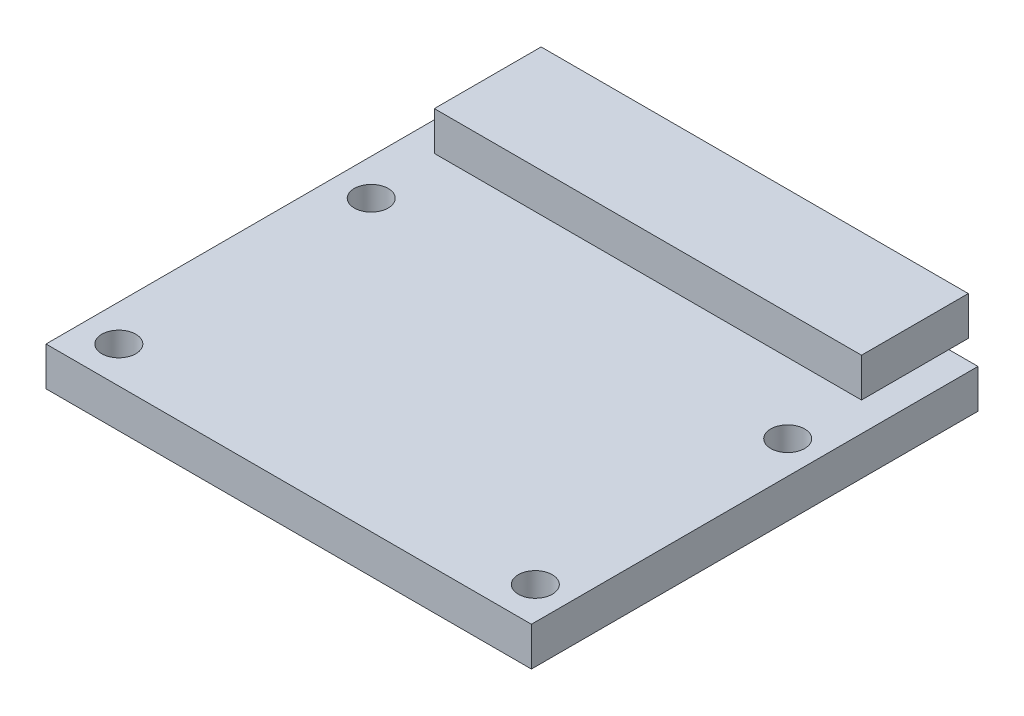
ISO-10303-21;
HEADER;
FILE_DESCRIPTION(('STEP AP214'),'2;1');
FILE_NAME('part.step','',(''),(''),'','','');
FILE_SCHEMA(('AUTOMOTIVE_DESIGN { 1 0 10303 214 1 1 1 1 }'));
ENDSEC;
DATA;
#1=APPLICATION_CONTEXT('core data for automotive mechanical design processes');
#2=APPLICATION_PROTOCOL_DEFINITION('international standard','automotive_design',2000,#1);
#3=PRODUCT_CONTEXT('',#1,'mechanical');
#4=PRODUCT('Part','Part','',(#3));
#5=PRODUCT_RELATED_PRODUCT_CATEGORY('part','',(#4));
#6=PRODUCT_DEFINITION_FORMATION('','',#4);
#7=PRODUCT_DEFINITION_CONTEXT('part definition',#1,'design');
#8=PRODUCT_DEFINITION('design','',#6,#7);
#9=PRODUCT_DEFINITION_SHAPE('','',#8);
#10=(LENGTH_UNIT() NAMED_UNIT(*) SI_UNIT(.MILLI.,.METRE.));
#11=(NAMED_UNIT(*) PLANE_ANGLE_UNIT() SI_UNIT($,.RADIAN.));
#12=(NAMED_UNIT(*) SI_UNIT($,.STERADIAN.) SOLID_ANGLE_UNIT());
#13=UNCERTAINTY_MEASURE_WITH_UNIT(LENGTH_MEASURE(1.E-05),#10,'distance_accuracy_value','');
#14=(GEOMETRIC_REPRESENTATION_CONTEXT(3) GLOBAL_UNCERTAINTY_ASSIGNED_CONTEXT((#13)) GLOBAL_UNIT_ASSIGNED_CONTEXT((#10,
#11,#12)) REPRESENTATION_CONTEXT('',''));
#15=CARTESIAN_POINT('',(0.,0.,0.));
#16=DIRECTION('',(0.,0.,1.));
#17=DIRECTION('',(1.,0.,0.));
#18=AXIS2_PLACEMENT_3D('',#15,#16,#17);
#19=CARTESIAN_POINT('',(0.,2.,0.));
#20=DIRECTION('',(0.,-1.,0.));
#21=DIRECTION('',(0.,0.,-1.));
#22=AXIS2_PLACEMENT_3D('',#19,#20,#21);
#23=PLANE('',#22);
#24=CARTESIAN_POINT('',(-10.625,2.,9.625));
#25=DIRECTION('',(0.,-1.,0.));
#26=DIRECTION('',(0.,0.,-1.));
#27=AXIS2_PLACEMENT_3D('',#24,#25,#26);
#28=CIRCLE('',#27,0.875);
#29=CARTESIAN_POINT('',(-10.625,2.,8.75));
#30=VERTEX_POINT('',#29);
#31=EDGE_CURVE('E186',#30,#30,#28,.T.);
#32=ORIENTED_EDGE('',*,*,#31,.T.);
#33=EDGE_LOOP('',(#32));
#34=FACE_BOUND('',#33,.T.);
#35=CARTESIAN_POINT('',(10.825,2.,9.625));
#36=DIRECTION('',(0.,-1.,0.));
#37=DIRECTION('',(0.,0.,-1.));
#38=AXIS2_PLACEMENT_3D('',#35,#36,#37);
#39=CIRCLE('',#38,0.875);
#40=CARTESIAN_POINT('',(10.825,2.,8.75));
#41=VERTEX_POINT('',#40);
#42=EDGE_CURVE('E190',#41,#41,#39,.T.);
#43=ORIENTED_EDGE('',*,*,#42,.T.);
#44=EDGE_LOOP('',(#43));
#45=FACE_BOUND('',#44,.T.);
#46=CARTESIAN_POINT('',(10.825,2.,-3.375));
#47=DIRECTION('',(0.,-1.,0.));
#48=DIRECTION('',(0.,0.,-1.));
#49=AXIS2_PLACEMENT_3D('',#46,#47,#48);
#50=CIRCLE('',#49,0.875);
#51=CARTESIAN_POINT('',(10.825,2.,-4.25));
#52=VERTEX_POINT('',#51);
#53=EDGE_CURVE('E194',#52,#52,#50,.T.);
#54=ORIENTED_EDGE('',*,*,#53,.T.);
#55=EDGE_LOOP('',(#54));
#56=FACE_BOUND('',#55,.T.);
#57=CARTESIAN_POINT('',(-10.625,2.,-3.375));
#58=DIRECTION('',(0.,-1.,0.));
#59=DIRECTION('',(0.,0.,-1.));
#60=AXIS2_PLACEMENT_3D('',#57,#58,#59);
#61=CIRCLE('',#60,0.875);
#62=CARTESIAN_POINT('',(-10.625,2.,-4.25));
#63=VERTEX_POINT('',#62);
#64=EDGE_CURVE('E198',#63,#63,#61,.T.);
#65=ORIENTED_EDGE('',*,*,#64,.T.);
#66=EDGE_LOOP('',(#65));
#67=FACE_BOUND('',#66,.T.);
#68=DIRECTION('',(0.,0.,-1.));
#69=VECTOR('',#68,1.);
#70=CARTESIAN_POINT('',(11.,2.,-7.));
#71=LINE('',#70,#69);
#72=CARTESIAN_POINT('',(11.,2.,-7.));
#73=VERTEX_POINT('',#72);
#74=CARTESIAN_POINT('',(11.,2.,-11.5));
#75=VERTEX_POINT('',#74);
#76=EDGE_CURVE('E58',#73,#75,#71,.T.);
#77=ORIENTED_EDGE('',*,*,#76,.F.);
#78=DIRECTION('',(1.,0.,0.));
#79=VECTOR('',#78,1.);
#80=CARTESIAN_POINT('',(-11.,2.,-7.));
#81=LINE('',#80,#79);
#82=CARTESIAN_POINT('',(-11.,2.,-7.));
#83=VERTEX_POINT('',#82);
#84=EDGE_CURVE('E157',#83,#73,#81,.T.);
#85=ORIENTED_EDGE('',*,*,#84,.F.);
#86=DIRECTION('',(0.,0.,1.));
#87=VECTOR('',#86,1.);
#88=CARTESIAN_POINT('',(-11.,2.,-7.));
#89=LINE('',#88,#87);
#90=CARTESIAN_POINT('',(-11.,2.,-11.5));
#91=VERTEX_POINT('',#90);
#92=EDGE_CURVE('E11',#91,#83,#89,.T.);
#93=ORIENTED_EDGE('',*,*,#92,.F.);
#94=DIRECTION('',(-1.,0.,0.));
#95=VECTOR('',#94,1.);
#96=CARTESIAN_POINT('',(-12.5,2.,-11.5));
#97=LINE('',#96,#95);
#98=CARTESIAN_POINT('',(-12.5,2.,-11.5));
#99=VERTEX_POINT('',#98);
#100=EDGE_CURVE('E259',#91,#99,#97,.T.);
#101=ORIENTED_EDGE('',*,*,#100,.T.);
#102=DIRECTION('',(0.,0.,1.));
#103=VECTOR('',#102,1.);
#104=CARTESIAN_POINT('',(-12.5,2.,11.5));
#105=LINE('',#104,#103);
#106=CARTESIAN_POINT('',(-12.5,2.,11.5));
#107=VERTEX_POINT('',#106);
#108=EDGE_CURVE('E264',#99,#107,#105,.T.);
#109=ORIENTED_EDGE('',*,*,#108,.T.);
#110=DIRECTION('',(1.,0.,0.));
#111=VECTOR('',#110,1.);
#112=CARTESIAN_POINT('',(-12.5,2.,11.5));
#113=LINE('',#112,#111);
#114=CARTESIAN_POINT('',(12.5,2.,11.5));
#115=VERTEX_POINT('',#114);
#116=EDGE_CURVE('E268',#107,#115,#113,.T.);
#117=ORIENTED_EDGE('',*,*,#116,.T.);
#118=DIRECTION('',(0.,0.,-1.));
#119=VECTOR('',#118,1.);
#120=CARTESIAN_POINT('',(12.5,2.,11.5));
#121=LINE('',#120,#119);
#122=CARTESIAN_POINT('',(12.5,2.,-11.5));
#123=VERTEX_POINT('',#122);
#124=EDGE_CURVE('E255',#115,#123,#121,.T.);
#125=ORIENTED_EDGE('',*,*,#124,.T.);
#126=EDGE_CURVE('E261',#123,#75,#97,.T.);
#127=ORIENTED_EDGE('',*,*,#126,.T.);
#128=EDGE_LOOP('',(#77,#85,#93,#101,#109,#117,#125,#127));
#129=FACE_BOUND('',#128,.T.);
#130=ADVANCED_FACE('F39',(#34,#45,#56,#67,#129),#23,.F.);
#131=CARTESIAN_POINT('',(12.5,2.,11.5));
#132=DIRECTION('',(-1.,0.,0.));
#133=DIRECTION('',(0.,0.,1.));
#134=AXIS2_PLACEMENT_3D('',#131,#132,#133);
#135=PLANE('',#134);
#136=DIRECTION('',(0.,0.,-1.));
#137=VECTOR('',#136,1.);
#138=CARTESIAN_POINT('',(12.5,0.,11.5));
#139=LINE('',#138,#137);
#140=CARTESIAN_POINT('',(12.5,0.,11.5));
#141=VERTEX_POINT('',#140);
#142=CARTESIAN_POINT('',(12.5,0.,-11.5));
#143=VERTEX_POINT('',#142);
#144=EDGE_CURVE('E254',#141,#143,#139,.T.);
#145=ORIENTED_EDGE('',*,*,#144,.T.);
#146=DIRECTION('',(0.,-1.,0.));
#147=VECTOR('',#146,1.);
#148=CARTESIAN_POINT('',(12.5,2.,-11.5));
#149=LINE('',#148,#147);
#150=EDGE_CURVE('E43',#123,#143,#149,.T.);
#151=ORIENTED_EDGE('',*,*,#150,.F.);
#152=ORIENTED_EDGE('',*,*,#124,.F.);
#153=DIRECTION('',(0.,-1.,0.));
#154=VECTOR('',#153,1.);
#155=CARTESIAN_POINT('',(12.5,2.,11.5));
#156=LINE('',#155,#154);
#157=EDGE_CURVE('E271',#115,#141,#156,.T.);
#158=ORIENTED_EDGE('',*,*,#157,.T.);
#159=EDGE_LOOP('',(#145,#151,#152,#158));
#160=FACE_BOUND('',#159,.T.);
#161=ADVANCED_FACE('F41',(#160),#135,.F.);
#162=CARTESIAN_POINT('',(-12.5,2.,-11.5));
#163=DIRECTION('',(0.,0.,1.));
#164=DIRECTION('',(1.,0.,0.));
#165=AXIS2_PLACEMENT_3D('',#162,#163,#164);
#166=PLANE('',#165);
#167=DIRECTION('',(-1.,0.,0.));
#168=VECTOR('',#167,1.);
#169=CARTESIAN_POINT('',(-12.5,0.,-11.5));
#170=LINE('',#169,#168);
#171=CARTESIAN_POINT('',(-12.5,0.,-11.5));
#172=VERTEX_POINT('',#171);
#173=EDGE_CURVE('E275',#143,#172,#170,.T.);
#174=ORIENTED_EDGE('',*,*,#173,.T.);
#175=DIRECTION('',(0.,-1.,0.));
#176=VECTOR('',#175,1.);
#177=CARTESIAN_POINT('',(-12.5,2.,-11.5));
#178=LINE('',#177,#176);
#179=EDGE_CURVE('E289',#99,#172,#178,.T.);
#180=ORIENTED_EDGE('',*,*,#179,.F.);
#181=ORIENTED_EDGE('',*,*,#100,.F.);
#182=EDGE_CURVE('E265',#75,#91,#97,.T.);
#183=ORIENTED_EDGE('',*,*,#182,.F.);
#184=ORIENTED_EDGE('',*,*,#126,.F.);
#185=ORIENTED_EDGE('',*,*,#150,.T.);
#186=EDGE_LOOP('',(#174,#180,#181,#183,#184,#185));
#187=FACE_BOUND('',#186,.T.);
#188=ADVANCED_FACE('F300',(#187),#166,.F.);
#189=CARTESIAN_POINT('',(-12.5,2.,11.5));
#190=DIRECTION('',(1.,0.,0.));
#191=DIRECTION('',(0.,0.,-1.));
#192=AXIS2_PLACEMENT_3D('',#189,#190,#191);
#193=PLANE('',#192);
#194=DIRECTION('',(0.,0.,1.));
#195=VECTOR('',#194,1.);
#196=CARTESIAN_POINT('',(-12.5,0.,11.5));
#197=LINE('',#196,#195);
#198=CARTESIAN_POINT('',(-12.5,0.,11.5));
#199=VERTEX_POINT('',#198);
#200=EDGE_CURVE('E278',#172,#199,#197,.T.);
#201=ORIENTED_EDGE('',*,*,#200,.T.);
#202=DIRECTION('',(0.,-1.,0.));
#203=VECTOR('',#202,1.);
#204=CARTESIAN_POINT('',(-12.5,2.,11.5));
#205=LINE('',#204,#203);
#206=EDGE_CURVE('E286',#107,#199,#205,.T.);
#207=ORIENTED_EDGE('',*,*,#206,.F.);
#208=ORIENTED_EDGE('',*,*,#108,.F.);
#209=ORIENTED_EDGE('',*,*,#179,.T.);
#210=EDGE_LOOP('',(#201,#207,#208,#209));
#211=FACE_BOUND('',#210,.T.);
#212=ADVANCED_FACE('F309',(#211),#193,.F.);
#213=CARTESIAN_POINT('',(-12.5,2.,11.5));
#214=DIRECTION('',(0.,0.,-1.));
#215=DIRECTION('',(-1.,0.,0.));
#216=AXIS2_PLACEMENT_3D('',#213,#214,#215);
#217=PLANE('',#216);
#218=DIRECTION('',(1.,0.,0.));
#219=VECTOR('',#218,1.);
#220=CARTESIAN_POINT('',(-12.5,0.,11.5));
#221=LINE('',#220,#219);
#222=EDGE_CURVE('E260',#199,#141,#221,.T.);
#223=ORIENTED_EDGE('',*,*,#222,.T.);
#224=ORIENTED_EDGE('',*,*,#157,.F.);
#225=ORIENTED_EDGE('',*,*,#116,.F.);
#226=ORIENTED_EDGE('',*,*,#206,.T.);
#227=EDGE_LOOP('',(#223,#224,#225,#226));
#228=FACE_BOUND('',#227,.T.);
#229=ADVANCED_FACE('F312',(#228),#217,.F.);
#230=CARTESIAN_POINT('',(0.,0.,0.));
#231=DIRECTION('',(0.,-1.,0.));
#232=DIRECTION('',(0.,0.,-1.));
#233=AXIS2_PLACEMENT_3D('',#230,#231,#232);
#234=PLANE('',#233);
#235=CARTESIAN_POINT('',(-10.625,0.,-3.375));
#236=DIRECTION('',(0.,-1.,0.));
#237=DIRECTION('',(0.,0.,-1.));
#238=AXIS2_PLACEMENT_3D('',#235,#236,#237);
#239=CIRCLE('',#238,0.875);
#240=CARTESIAN_POINT('',(-10.625,0.,-4.25));
#241=VERTEX_POINT('',#240);
#242=EDGE_CURVE('E164',#241,#241,#239,.T.);
#243=ORIENTED_EDGE('',*,*,#242,.F.);
#244=EDGE_LOOP('',(#243));
#245=FACE_BOUND('',#244,.T.);
#246=CARTESIAN_POINT('',(10.825,0.,-3.375));
#247=DIRECTION('',(0.,-1.,0.));
#248=DIRECTION('',(0.,0.,-1.));
#249=AXIS2_PLACEMENT_3D('',#246,#247,#248);
#250=CIRCLE('',#249,0.875);
#251=CARTESIAN_POINT('',(10.825,0.,-4.25));
#252=VERTEX_POINT('',#251);
#253=EDGE_CURVE('E169',#252,#252,#250,.T.);
#254=ORIENTED_EDGE('',*,*,#253,.F.);
#255=EDGE_LOOP('',(#254));
#256=FACE_BOUND('',#255,.T.);
#257=CARTESIAN_POINT('',(10.825,0.,9.625));
#258=DIRECTION('',(0.,-1.,0.));
#259=DIRECTION('',(0.,0.,-1.));
#260=AXIS2_PLACEMENT_3D('',#257,#258,#259);
#261=CIRCLE('',#260,0.875);
#262=CARTESIAN_POINT('',(10.825,0.,8.75));
#263=VERTEX_POINT('',#262);
#264=EDGE_CURVE('E175',#263,#263,#261,.T.);
#265=ORIENTED_EDGE('',*,*,#264,.F.);
#266=EDGE_LOOP('',(#265));
#267=FACE_BOUND('',#266,.T.);
#268=CARTESIAN_POINT('',(-10.625,0.,9.625));
#269=DIRECTION('',(0.,-1.,0.));
#270=DIRECTION('',(0.,0.,-1.));
#271=AXIS2_PLACEMENT_3D('',#268,#269,#270);
#272=CIRCLE('',#271,0.875);
#273=CARTESIAN_POINT('',(-10.625,0.,8.75));
#274=VERTEX_POINT('',#273);
#275=EDGE_CURVE('E179',#274,#274,#272,.T.);
#276=ORIENTED_EDGE('',*,*,#275,.F.);
#277=EDGE_LOOP('',(#276));
#278=FACE_BOUND('',#277,.T.);
#279=DIRECTION('',(0.,0.,1.));
#280=VECTOR('',#279,1.);
#281=CARTESIAN_POINT('',(4.25,0.,-6.));
#282=LINE('',#281,#280);
#283=CARTESIAN_POINT('',(4.25,0.,-6.));
#284=VERTEX_POINT('',#283);
#285=CARTESIAN_POINT('',(4.25,0.,2.5));
#286=VERTEX_POINT('',#285);
#287=EDGE_CURVE('E206',#284,#286,#282,.T.);
#288=ORIENTED_EDGE('',*,*,#287,.F.);
#289=DIRECTION('',(1.,0.,0.));
#290=VECTOR('',#289,1.);
#291=CARTESIAN_POINT('',(-4.25,0.,-6.));
#292=LINE('',#291,#290);
#293=CARTESIAN_POINT('',(-4.25,0.,-6.));
#294=VERTEX_POINT('',#293);
#295=EDGE_CURVE('E215',#294,#284,#292,.T.);
#296=ORIENTED_EDGE('',*,*,#295,.F.);
#297=DIRECTION('',(0.,0.,-1.));
#298=VECTOR('',#297,1.);
#299=CARTESIAN_POINT('',(-4.25,0.,-6.));
#300=LINE('',#299,#298);
#301=CARTESIAN_POINT('',(-4.25,0.,2.5));
#302=VERTEX_POINT('',#301);
#303=EDGE_CURVE('E232',#302,#294,#300,.T.);
#304=ORIENTED_EDGE('',*,*,#303,.F.);
#305=DIRECTION('',(-1.,0.,0.));
#306=VECTOR('',#305,1.);
#307=CARTESIAN_POINT('',(-4.25,0.,2.5));
#308=LINE('',#307,#306);
#309=EDGE_CURVE('E228',#286,#302,#308,.T.);
#310=ORIENTED_EDGE('',*,*,#309,.F.);
#311=EDGE_LOOP('',(#288,#296,#304,#310));
#312=FACE_BOUND('',#311,.T.);
#313=ORIENTED_EDGE('',*,*,#144,.F.);
#314=ORIENTED_EDGE('',*,*,#222,.F.);
#315=ORIENTED_EDGE('',*,*,#200,.F.);
#316=ORIENTED_EDGE('',*,*,#173,.F.);
#317=EDGE_LOOP('',(#313,#314,#315,#316));
#318=FACE_BOUND('',#317,.T.);
#319=ADVANCED_FACE('F307',(#245,#256,#267,#278,#312,#318),#234,.T.);
#320=CARTESIAN_POINT('',(4.25,-3.,-6.));
#321=DIRECTION('',(-1.,0.,0.));
#322=DIRECTION('',(0.,0.,1.));
#323=AXIS2_PLACEMENT_3D('',#320,#321,#322);
#324=PLANE('',#323);
#325=ORIENTED_EDGE('',*,*,#287,.T.);
#326=DIRECTION('',(0.,1.,0.));
#327=VECTOR('',#326,1.);
#328=CARTESIAN_POINT('',(4.25,-3.,2.5));
#329=LINE('',#328,#327);
#330=CARTESIAN_POINT('',(4.25,-3.,2.5));
#331=VERTEX_POINT('',#330);
#332=EDGE_CURVE('E250',#331,#286,#329,.T.);
#333=ORIENTED_EDGE('',*,*,#332,.F.);
#334=DIRECTION('',(0.,0.,1.));
#335=VECTOR('',#334,1.);
#336=CARTESIAN_POINT('',(4.25,-3.,-6.));
#337=LINE('',#336,#335);
#338=CARTESIAN_POINT('',(4.25,-3.,-6.));
#339=VERTEX_POINT('',#338);
#340=EDGE_CURVE('E210',#339,#331,#337,.T.);
#341=ORIENTED_EDGE('',*,*,#340,.F.);
#342=DIRECTION('',(0.,1.,0.));
#343=VECTOR('',#342,1.);
#344=CARTESIAN_POINT('',(4.25,-3.,-6.));
#345=LINE('',#344,#343);
#346=EDGE_CURVE('E224',#339,#284,#345,.T.);
#347=ORIENTED_EDGE('',*,*,#346,.T.);
#348=EDGE_LOOP('',(#325,#333,#341,#347));
#349=FACE_BOUND('',#348,.T.);
#350=ADVANCED_FACE('F361',(#349),#324,.F.);
#351=CARTESIAN_POINT('',(-4.25,-3.,2.5));
#352=DIRECTION('',(0.,0.,-1.));
#353=DIRECTION('',(-1.,0.,0.));
#354=AXIS2_PLACEMENT_3D('',#351,#352,#353);
#355=PLANE('',#354);
#356=ORIENTED_EDGE('',*,*,#309,.T.);
#357=DIRECTION('',(0.,1.,0.));
#358=VECTOR('',#357,1.);
#359=CARTESIAN_POINT('',(-4.25,-3.,2.5));
#360=LINE('',#359,#358);
#361=CARTESIAN_POINT('',(-4.25,-3.,2.5));
#362=VERTEX_POINT('',#361);
#363=EDGE_CURVE('E246',#362,#302,#360,.T.);
#364=ORIENTED_EDGE('',*,*,#363,.F.);
#365=DIRECTION('',(-1.,0.,0.));
#366=VECTOR('',#365,1.);
#367=CARTESIAN_POINT('',(-4.25,-3.,2.5));
#368=LINE('',#367,#366);
#369=EDGE_CURVE('E214',#331,#362,#368,.T.);
#370=ORIENTED_EDGE('',*,*,#369,.F.);
#371=ORIENTED_EDGE('',*,*,#332,.T.);
#372=EDGE_LOOP('',(#356,#364,#370,#371));
#373=FACE_BOUND('',#372,.T.);
#374=ADVANCED_FACE('F395',(#373),#355,.F.);
#375=CARTESIAN_POINT('',(-4.25,-3.,-6.));
#376=DIRECTION('',(1.,0.,0.));
#377=DIRECTION('',(0.,0.,-1.));
#378=AXIS2_PLACEMENT_3D('',#375,#376,#377);
#379=PLANE('',#378);
#380=ORIENTED_EDGE('',*,*,#303,.T.);
#381=DIRECTION('',(0.,1.,0.));
#382=VECTOR('',#381,1.);
#383=CARTESIAN_POINT('',(-4.25,-3.,-6.));
#384=LINE('',#383,#382);
#385=CARTESIAN_POINT('',(-4.25,-3.,-6.));
#386=VERTEX_POINT('',#385);
#387=EDGE_CURVE('E242',#386,#294,#384,.T.);
#388=ORIENTED_EDGE('',*,*,#387,.F.);
#389=DIRECTION('',(0.,0.,-1.));
#390=VECTOR('',#389,1.);
#391=CARTESIAN_POINT('',(-4.25,-3.,-6.));
#392=LINE('',#391,#390);
#393=EDGE_CURVE('E218',#362,#386,#392,.T.);
#394=ORIENTED_EDGE('',*,*,#393,.F.);
#395=ORIENTED_EDGE('',*,*,#363,.T.);
#396=EDGE_LOOP('',(#380,#388,#394,#395));
#397=FACE_BOUND('',#396,.T.);
#398=ADVANCED_FACE('F402',(#397),#379,.F.);
#399=CARTESIAN_POINT('',(-4.25,-3.,-6.));
#400=DIRECTION('',(0.,0.,1.));
#401=DIRECTION('',(1.,0.,0.));
#402=AXIS2_PLACEMENT_3D('',#399,#400,#401);
#403=PLANE('',#402);
#404=ORIENTED_EDGE('',*,*,#295,.T.);
#405=ORIENTED_EDGE('',*,*,#346,.F.);
#406=DIRECTION('',(1.,0.,0.));
#407=VECTOR('',#406,1.);
#408=CARTESIAN_POINT('',(-4.25,-3.,-6.));
#409=LINE('',#408,#407);
#410=EDGE_CURVE('E221',#386,#339,#409,.T.);
#411=ORIENTED_EDGE('',*,*,#410,.F.);
#412=ORIENTED_EDGE('',*,*,#387,.T.);
#413=EDGE_LOOP('',(#404,#405,#411,#412));
#414=FACE_BOUND('',#413,.T.);
#415=ADVANCED_FACE('F409',(#414),#403,.F.);
#416=CARTESIAN_POINT('',(0.,-3.,0.));
#417=DIRECTION('',(0.,1.,0.));
#418=DIRECTION('',(0.,0.,1.));
#419=AXIS2_PLACEMENT_3D('',#416,#417,#418);
#420=PLANE('',#419);
#421=CARTESIAN_POINT('',(0.,-3.,-1.75));
#422=DIRECTION('',(0.,-1.,0.));
#423=DIRECTION('',(0.,0.,-1.));
#424=AXIS2_PLACEMENT_3D('',#421,#422,#423);
#425=CIRCLE('',#424,3.75);
#426=CARTESIAN_POINT('',(0.,-3.,-5.5));
#427=VERTEX_POINT('',#426);
#428=EDGE_CURVE('E49',#427,#427,#425,.T.);
#429=ORIENTED_EDGE('',*,*,#428,.F.);
#430=EDGE_LOOP('',(#429));
#431=FACE_BOUND('',#430,.T.);
#432=ORIENTED_EDGE('',*,*,#340,.T.);
#433=ORIENTED_EDGE('',*,*,#369,.T.);
#434=ORIENTED_EDGE('',*,*,#393,.T.);
#435=ORIENTED_EDGE('',*,*,#410,.T.);
#436=EDGE_LOOP('',(#432,#433,#434,#435));
#437=FACE_BOUND('',#436,.T.);
#438=ADVANCED_FACE('F417',(#431,#437),#420,.F.);
#439=CARTESIAN_POINT('',(0.,-6.,-1.75));
#440=DIRECTION('',(0.,1.,0.));
#441=DIRECTION('',(0.,0.,1.));
#442=AXIS2_PLACEMENT_3D('',#439,#440,#441);
#443=CYLINDRICAL_SURFACE('',#442,3.75);
#444=CARTESIAN_POINT('',(0.,-6.,-1.75));
#445=DIRECTION('',(0.,-1.,0.));
#446=DIRECTION('',(0.,0.,-1.));
#447=AXIS2_PLACEMENT_3D('',#444,#445,#446);
#448=CIRCLE('',#447,3.75);
#449=CARTESIAN_POINT('',(0.,-6.,-5.5));
#450=VERTEX_POINT('',#449);
#451=EDGE_CURVE('E202',#450,#450,#448,.T.);
#452=ORIENTED_EDGE('',*,*,#451,.F.);
#453=EDGE_LOOP('',(#452));
#454=FACE_BOUND('',#453,.T.);
#455=ORIENTED_EDGE('',*,*,#428,.T.);
#456=EDGE_LOOP('',(#455));
#457=FACE_BOUND('',#456,.T.);
#458=ADVANCED_FACE('F425',(#454,#457),#443,.T.);
#459=CARTESIAN_POINT('',(0.,-6.,-1.75));
#460=DIRECTION('',(0.,-1.,0.));
#461=DIRECTION('',(0.,0.,-1.));
#462=AXIS2_PLACEMENT_3D('',#459,#460,#461);
#463=PLANE('',#462);
#464=ORIENTED_EDGE('',*,*,#451,.T.);
#465=EDGE_LOOP('',(#464));
#466=FACE_BOUND('',#465,.T.);
#467=ADVANCED_FACE('F433',(#466),#463,.T.);
#468=CARTESIAN_POINT('',(-10.625,3.,9.625));
#469=DIRECTION('',(0.,-1.,0.));
#470=DIRECTION('',(0.,0.,-1.));
#471=AXIS2_PLACEMENT_3D('',#468,#469,#470);
#472=CYLINDRICAL_SURFACE('',#471,0.875);
#473=ORIENTED_EDGE('',*,*,#275,.T.);
#474=EDGE_LOOP('',(#473));
#475=FACE_BOUND('',#474,.T.);
#476=ORIENTED_EDGE('',*,*,#31,.F.);
#477=EDGE_LOOP('',(#476));
#478=FACE_BOUND('',#477,.T.);
#479=ADVANCED_FACE('F440',(#475,#478),#472,.F.);
#480=CARTESIAN_POINT('',(10.825,3.,9.625));
#481=DIRECTION('',(0.,-1.,0.));
#482=DIRECTION('',(0.,0.,-1.));
#483=AXIS2_PLACEMENT_3D('',#480,#481,#482);
#484=CYLINDRICAL_SURFACE('',#483,0.875);
#485=ORIENTED_EDGE('',*,*,#264,.T.);
#486=EDGE_LOOP('',(#485));
#487=FACE_BOUND('',#486,.T.);
#488=ORIENTED_EDGE('',*,*,#42,.F.);
#489=EDGE_LOOP('',(#488));
#490=FACE_BOUND('',#489,.T.);
#491=ADVANCED_FACE('F447',(#487,#490),#484,.F.);
#492=CARTESIAN_POINT('',(10.825,3.,-3.375));
#493=DIRECTION('',(0.,-1.,0.));
#494=DIRECTION('',(0.,0.,-1.));
#495=AXIS2_PLACEMENT_3D('',#492,#493,#494);
#496=CYLINDRICAL_SURFACE('',#495,0.875);
#497=ORIENTED_EDGE('',*,*,#253,.T.);
#498=EDGE_LOOP('',(#497));
#499=FACE_BOUND('',#498,.T.);
#500=ORIENTED_EDGE('',*,*,#53,.F.);
#501=EDGE_LOOP('',(#500));
#502=FACE_BOUND('',#501,.T.);
#503=ADVANCED_FACE('F455',(#499,#502),#496,.F.);
#504=CARTESIAN_POINT('',(-10.625,3.,-3.375));
#505=DIRECTION('',(0.,-1.,0.));
#506=DIRECTION('',(0.,0.,-1.));
#507=AXIS2_PLACEMENT_3D('',#504,#505,#506);
#508=CYLINDRICAL_SURFACE('',#507,0.875);
#509=ORIENTED_EDGE('',*,*,#242,.T.);
#510=EDGE_LOOP('',(#509));
#511=FACE_BOUND('',#510,.T.);
#512=ORIENTED_EDGE('',*,*,#64,.F.);
#513=EDGE_LOOP('',(#512));
#514=FACE_BOUND('',#513,.T.);
#515=ADVANCED_FACE('F463',(#511,#514),#508,.F.);
#516=CARTESIAN_POINT('',(11.,4.,-7.));
#517=DIRECTION('',(-1.,0.,0.));
#518=DIRECTION('',(0.,0.,1.));
#519=AXIS2_PLACEMENT_3D('',#516,#517,#518);
#520=PLANE('',#519);
#521=ORIENTED_EDGE('',*,*,#76,.T.);
#522=CARTESIAN_POINT('',(11.,2.,-12.5));
#523=VERTEX_POINT('',#522);
#524=EDGE_CURVE('E161',#75,#523,#71,.T.);
#525=ORIENTED_EDGE('',*,*,#524,.T.);
#526=DIRECTION('',(0.,-1.,0.));
#527=VECTOR('',#526,1.);
#528=CARTESIAN_POINT('',(11.,4.,-12.5));
#529=LINE('',#528,#527);
#530=CARTESIAN_POINT('',(11.,4.,-12.5));
#531=VERTEX_POINT('',#530);
#532=EDGE_CURVE('E140',#531,#523,#529,.T.);
#533=ORIENTED_EDGE('',*,*,#532,.F.);
#534=DIRECTION('',(0.,0.,-1.));
#535=VECTOR('',#534,1.);
#536=CARTESIAN_POINT('',(11.,4.,-7.));
#537=LINE('',#536,#535);
#538=CARTESIAN_POINT('',(11.,4.,-7.));
#539=VERTEX_POINT('',#538);
#540=EDGE_CURVE('E147',#539,#531,#537,.T.);
#541=ORIENTED_EDGE('',*,*,#540,.F.);
#542=DIRECTION('',(0.,-1.,0.));
#543=VECTOR('',#542,1.);
#544=CARTESIAN_POINT('',(11.,4.,-7.));
#545=LINE('',#544,#543);
#546=EDGE_CURVE('E332',#539,#73,#545,.T.);
#547=ORIENTED_EDGE('',*,*,#546,.T.);
#548=EDGE_LOOP('',(#521,#525,#533,#541,#547));
#549=FACE_BOUND('',#548,.T.);
#550=ADVANCED_FACE('F159',(#549),#520,.F.);
#551=CARTESIAN_POINT('',(-11.,4.,-12.5));
#552=DIRECTION('',(0.,0.,1.));
#553=DIRECTION('',(1.,0.,0.));
#554=AXIS2_PLACEMENT_3D('',#551,#552,#553);
#555=PLANE('',#554);
#556=DIRECTION('',(-1.,0.,0.));
#557=VECTOR('',#556,1.);
#558=CARTESIAN_POINT('',(-11.,2.,-12.5));
#559=LINE('',#558,#557);
#560=CARTESIAN_POINT('',(-11.,2.,-12.5));
#561=VERTEX_POINT('',#560);
#562=EDGE_CURVE('E325',#523,#561,#559,.T.);
#563=ORIENTED_EDGE('',*,*,#562,.T.);
#564=DIRECTION('',(0.,-1.,0.));
#565=VECTOR('',#564,1.);
#566=CARTESIAN_POINT('',(-11.,4.,-12.5));
#567=LINE('',#566,#565);
#568=CARTESIAN_POINT('',(-11.,4.,-12.5));
#569=VERTEX_POINT('',#568);
#570=EDGE_CURVE('E142',#569,#561,#567,.T.);
#571=ORIENTED_EDGE('',*,*,#570,.F.);
#572=DIRECTION('',(-1.,0.,0.));
#573=VECTOR('',#572,1.);
#574=CARTESIAN_POINT('',(-11.,4.,-12.5));
#575=LINE('',#574,#573);
#576=EDGE_CURVE('E136',#531,#569,#575,.T.);
#577=ORIENTED_EDGE('',*,*,#576,.F.);
#578=ORIENTED_EDGE('',*,*,#532,.T.);
#579=EDGE_LOOP('',(#563,#571,#577,#578));
#580=FACE_BOUND('',#579,.T.);
#581=ADVANCED_FACE('F138',(#580),#555,.F.);
#582=CARTESIAN_POINT('',(-11.,4.,-7.));
#583=DIRECTION('',(1.,0.,0.));
#584=DIRECTION('',(0.,0.,-1.));
#585=AXIS2_PLACEMENT_3D('',#582,#583,#584);
#586=PLANE('',#585);
#587=EDGE_CURVE('E51',#561,#91,#89,.T.);
#588=ORIENTED_EDGE('',*,*,#587,.T.);
#589=ORIENTED_EDGE('',*,*,#92,.T.);
#590=DIRECTION('',(0.,-1.,0.));
#591=VECTOR('',#590,1.);
#592=CARTESIAN_POINT('',(-11.,4.,-7.));
#593=LINE('',#592,#591);
#594=CARTESIAN_POINT('',(-11.,4.,-7.));
#595=VERTEX_POINT('',#594);
#596=EDGE_CURVE('E171',#595,#83,#593,.T.);
#597=ORIENTED_EDGE('',*,*,#596,.F.);
#598=DIRECTION('',(0.,0.,1.));
#599=VECTOR('',#598,1.);
#600=CARTESIAN_POINT('',(-11.,4.,-7.));
#601=LINE('',#600,#599);
#602=EDGE_CURVE('E146',#569,#595,#601,.T.);
#603=ORIENTED_EDGE('',*,*,#602,.F.);
#604=ORIENTED_EDGE('',*,*,#570,.T.);
#605=EDGE_LOOP('',(#588,#589,#597,#603,#604));
#606=FACE_BOUND('',#605,.T.);
#607=ADVANCED_FACE('F321',(#606),#586,.F.);
#608=CARTESIAN_POINT('',(-11.,4.,-7.));
#609=DIRECTION('',(0.,0.,-1.));
#610=DIRECTION('',(-1.,0.,0.));
#611=AXIS2_PLACEMENT_3D('',#608,#609,#610);
#612=PLANE('',#611);
#613=ORIENTED_EDGE('',*,*,#84,.T.);
#614=ORIENTED_EDGE('',*,*,#546,.F.);
#615=DIRECTION('',(1.,0.,0.));
#616=VECTOR('',#615,1.);
#617=CARTESIAN_POINT('',(-11.,4.,-7.));
#618=LINE('',#617,#616);
#619=EDGE_CURVE('E152',#595,#539,#618,.T.);
#620=ORIENTED_EDGE('',*,*,#619,.F.);
#621=ORIENTED_EDGE('',*,*,#596,.T.);
#622=EDGE_LOOP('',(#613,#614,#620,#621));
#623=FACE_BOUND('',#622,.T.);
#624=ADVANCED_FACE('F336',(#623),#612,.F.);
#625=CARTESIAN_POINT('',(0.,4.,0.));
#626=DIRECTION('',(0.,-1.,0.));
#627=DIRECTION('',(0.,0.,-1.));
#628=AXIS2_PLACEMENT_3D('',#625,#626,#627);
#629=PLANE('',#628);
#630=ORIENTED_EDGE('',*,*,#540,.T.);
#631=ORIENTED_EDGE('',*,*,#576,.T.);
#632=ORIENTED_EDGE('',*,*,#602,.T.);
#633=ORIENTED_EDGE('',*,*,#619,.T.);
#634=EDGE_LOOP('',(#630,#631,#632,#633));
#635=FACE_BOUND('',#634,.T.);
#636=ADVANCED_FACE('F150',(#635),#629,.F.);
#637=CARTESIAN_POINT('',(0.,2.,0.));
#638=DIRECTION('',(0.,-1.,0.));
#639=DIRECTION('',(0.,0.,-1.));
#640=AXIS2_PLACEMENT_3D('',#637,#638,#639);
#641=PLANE('',#640);
#642=ORIENTED_EDGE('',*,*,#524,.F.);
#643=ORIENTED_EDGE('',*,*,#182,.T.);
#644=ORIENTED_EDGE('',*,*,#587,.F.);
#645=ORIENTED_EDGE('',*,*,#562,.F.);
#646=EDGE_LOOP('',(#642,#643,#644,#645));
#647=FACE_BOUND('',#646,.T.);
#648=ADVANCED_FACE('F319',(#647),#641,.T.);
#649=CLOSED_SHELL('',(#130,#161,#188,#212,#229,#319,#350,#374,#398,#415,#438,#458,#467,#479,
#491,#503,#515,#550,#581,#607,#624,#636,#648));
#650=MANIFOLD_SOLID_BREP('B2',#649);
#651=ADVANCED_BREP_SHAPE_REPRESENTATION('',(#18,#650),#14);
#652=SHAPE_DEFINITION_REPRESENTATION(#9,#651);
ENDSEC;
END-ISO-10303-21;
